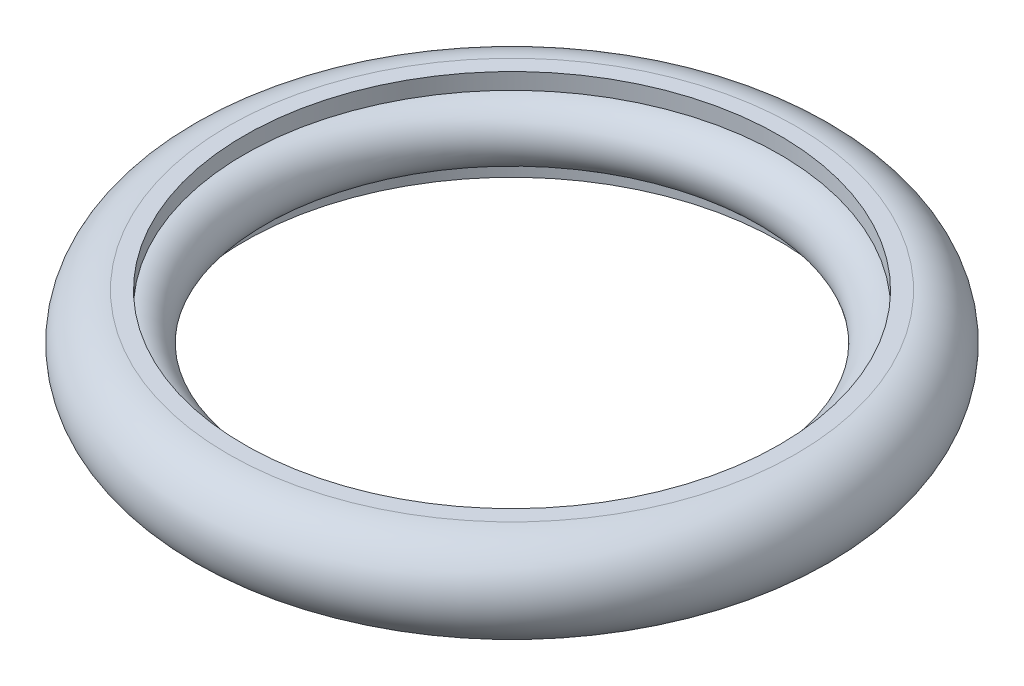
ISO-10303-21;
HEADER;
FILE_DESCRIPTION(('STEP AP214'),'2;1');
FILE_NAME('part.step','',(''),(''),'','','');
FILE_SCHEMA(('AUTOMOTIVE_DESIGN { 1 0 10303 214 1 1 1 1 }'));
ENDSEC;
DATA;
#1=APPLICATION_CONTEXT('core data for automotive mechanical design processes');
#2=APPLICATION_PROTOCOL_DEFINITION('international standard','automotive_design',2000,#1);
#3=PRODUCT_CONTEXT('',#1,'mechanical');
#4=PRODUCT('Part','Part','',(#3));
#5=PRODUCT_RELATED_PRODUCT_CATEGORY('part','',(#4));
#6=PRODUCT_DEFINITION_FORMATION('','',#4);
#7=PRODUCT_DEFINITION_CONTEXT('part definition',#1,'design');
#8=PRODUCT_DEFINITION('design','',#6,#7);
#9=PRODUCT_DEFINITION_SHAPE('','',#8);
#10=(LENGTH_UNIT() NAMED_UNIT(*) SI_UNIT(.MILLI.,.METRE.));
#11=(NAMED_UNIT(*) PLANE_ANGLE_UNIT() SI_UNIT($,.RADIAN.));
#12=(NAMED_UNIT(*) SI_UNIT($,.STERADIAN.) SOLID_ANGLE_UNIT());
#13=UNCERTAINTY_MEASURE_WITH_UNIT(LENGTH_MEASURE(1.E-05),#10,'distance_accuracy_value','');
#14=(GEOMETRIC_REPRESENTATION_CONTEXT(3) GLOBAL_UNCERTAINTY_ASSIGNED_CONTEXT((#13)) GLOBAL_UNIT_ASSIGNED_CONTEXT((#10,
#11,#12)) REPRESENTATION_CONTEXT('',''));
#15=CARTESIAN_POINT('',(0.,0.,0.));
#16=DIRECTION('',(0.,0.,1.));
#17=DIRECTION('',(1.,0.,0.));
#18=AXIS2_PLACEMENT_3D('',#15,#16,#17);
#19=CARTESIAN_POINT('',(0.,0.,0.));
#20=DIRECTION('',(0.,-1.,0.));
#21=DIRECTION('',(-1.,0.,0.));
#22=AXIS2_PLACEMENT_3D('',#19,#20,#21);
#23=TOROIDAL_SURFACE('',#22,11.785,1.3);
#24=CARTESIAN_POINT('',(0.,-1.3,0.));
#25=DIRECTION('',(0.,-1.,0.));
#26=DIRECTION('',(1.,0.,0.));
#27=AXIS2_PLACEMENT_3D('',#24,#25,#26);
#28=CIRCLE('',#27,11.785);
#29=CARTESIAN_POINT('',(11.785,-1.3,0.));
#30=VERTEX_POINT('',#29);
#31=EDGE_CURVE('E132',#30,#30,#28,.T.);
#32=ORIENTED_EDGE('',*,*,#31,.T.);
#33=EDGE_LOOP('',(#32));
#34=FACE_BOUND('',#33,.T.);
#35=CARTESIAN_POINT('',(0.,1.3,0.));
#36=DIRECTION('',(0.,-1.,0.));
#37=DIRECTION('',(1.,0.,0.));
#38=AXIS2_PLACEMENT_3D('',#35,#36,#37);
#39=CIRCLE('',#38,11.785);
#40=CARTESIAN_POINT('',(11.785,1.3,0.));
#41=VERTEX_POINT('',#40);
#42=EDGE_CURVE('E135',#41,#41,#39,.F.);
#43=ORIENTED_EDGE('',*,*,#42,.T.);
#44=EDGE_LOOP('',(#43));
#45=FACE_BOUND('',#44,.T.);
#46=ADVANCED_FACE('F16',(#34,#45),#23,.T.);
#47=CARTESIAN_POINT('',(0.,2.217875,0.));
#48=DIRECTION('',(0.,-1.,0.));
#49=DIRECTION('',(1.,0.,0.));
#50=AXIS2_PLACEMENT_3D('',#47,#48,#49);
#51=CYLINDRICAL_SURFACE('',#50,11.785);
#52=ORIENTED_EDGE('',*,*,#42,.F.);
#53=EDGE_LOOP('',(#52));
#54=FACE_BOUND('',#53,.T.);
#55=CARTESIAN_POINT('',(0.,2.01625,0.));
#56=DIRECTION('',(0.,-1.,0.));
#57=DIRECTION('',(1.,0.,0.));
#58=AXIS2_PLACEMENT_3D('',#55,#56,#57);
#59=CIRCLE('',#58,11.785);
#60=CARTESIAN_POINT('',(11.785,2.01625,0.));
#61=VERTEX_POINT('',#60);
#62=EDGE_CURVE('E57',#61,#61,#59,.F.);
#63=ORIENTED_EDGE('',*,*,#62,.T.);
#64=EDGE_LOOP('',(#63));
#65=FACE_BOUND('',#64,.T.);
#66=ADVANCED_FACE('F144',(#54,#65),#51,.F.);
#67=CARTESIAN_POINT('',(0.,2.217875,0.));
#68=DIRECTION('',(0.,-1.,0.));
#69=DIRECTION('',(1.,0.,0.));
#70=AXIS2_PLACEMENT_3D('',#67,#68,#69);
#71=CYLINDRICAL_SURFACE('',#70,11.785);
#72=CARTESIAN_POINT('',(0.,-2.01625,0.));
#73=DIRECTION('',(0.,-1.,0.));
#74=DIRECTION('',(1.,0.,0.));
#75=AXIS2_PLACEMENT_3D('',#72,#73,#74);
#76=CIRCLE('',#75,11.785);
#77=CARTESIAN_POINT('',(11.785,-2.01625,0.));
#78=VERTEX_POINT('',#77);
#79=EDGE_CURVE('E137',#78,#78,#76,.F.);
#80=ORIENTED_EDGE('',*,*,#79,.F.);
#81=EDGE_LOOP('',(#80));
#82=FACE_BOUND('',#81,.T.);
#83=ORIENTED_EDGE('',*,*,#31,.F.);
#84=EDGE_LOOP('',(#83));
#85=FACE_BOUND('',#84,.T.);
#86=ADVANCED_FACE('F112',(#82,#85),#71,.F.);
#87=CARTESIAN_POINT('',(0.,2.01625,0.));
#88=DIRECTION('',(0.,-1.,0.));
#89=DIRECTION('',(1.,0.,0.));
#90=AXIS2_PLACEMENT_3D('',#87,#88,#89);
#91=PLANE('',#90);
#92=ORIENTED_EDGE('',*,*,#62,.F.);
#93=EDGE_LOOP('',(#92));
#94=FACE_BOUND('',#93,.T.);
#95=CARTESIAN_POINT('',(0.,2.01625,0.));
#96=DIRECTION('',(0.,-1.,0.));
#97=DIRECTION('',(-1.,0.,0.));
#98=AXIS2_PLACEMENT_3D('',#95,#96,#97);
#99=CIRCLE('',#98,12.50125);
#100=CARTESIAN_POINT('',(-12.50125,2.01625,0.));
#101=VERTEX_POINT('',#100);
#102=CARTESIAN_POINT('',(12.50125,2.01625,0.));
#103=VERTEX_POINT('',#102);
#104=EDGE_CURVE('E47',#101,#103,#99,.T.);
#105=ORIENTED_EDGE('',*,*,#104,.F.);
#106=CARTESIAN_POINT('',(0.,2.01625,0.));
#107=DIRECTION('',(0.,-1.,0.));
#108=DIRECTION('',(1.,0.,0.));
#109=AXIS2_PLACEMENT_3D('',#106,#107,#108);
#110=CIRCLE('',#109,12.50125);
#111=EDGE_CURVE('E27',#103,#101,#110,.T.);
#112=ORIENTED_EDGE('',*,*,#111,.F.);
#113=EDGE_LOOP('',(#105,#112));
#114=FACE_BOUND('',#113,.T.);
#115=ADVANCED_FACE('F46',(#94,#114),#91,.F.);
#116=CARTESIAN_POINT('',(0.,-2.01625,0.));
#117=DIRECTION('',(0.,-1.,0.));
#118=DIRECTION('',(1.,0.,0.));
#119=AXIS2_PLACEMENT_3D('',#116,#117,#118);
#120=PLANE('',#119);
#121=ORIENTED_EDGE('',*,*,#79,.T.);
#122=EDGE_LOOP('',(#121));
#123=FACE_BOUND('',#122,.T.);
#124=CARTESIAN_POINT('',(0.,-2.01625,0.));
#125=DIRECTION('',(0.,1.,0.));
#126=DIRECTION('',(1.,0.,0.));
#127=AXIS2_PLACEMENT_3D('',#124,#125,#126);
#128=CIRCLE('',#127,12.50125);
#129=CARTESIAN_POINT('',(12.50125,-2.01625,0.));
#130=VERTEX_POINT('',#129);
#131=CARTESIAN_POINT('',(-12.50125,-2.01625,0.));
#132=VERTEX_POINT('',#131);
#133=EDGE_CURVE('E33',#130,#132,#128,.T.);
#134=ORIENTED_EDGE('',*,*,#133,.F.);
#135=CARTESIAN_POINT('',(0.,-2.01625,0.));
#136=DIRECTION('',(0.,1.,0.));
#137=DIRECTION('',(-1.,0.,0.));
#138=AXIS2_PLACEMENT_3D('',#135,#136,#137);
#139=CIRCLE('',#138,12.50125);
#140=EDGE_CURVE('E10',#132,#130,#139,.T.);
#141=ORIENTED_EDGE('',*,*,#140,.F.);
#142=EDGE_LOOP('',(#134,#141));
#143=FACE_BOUND('',#142,.T.);
#144=ADVANCED_FACE('F70',(#123,#143),#120,.T.);
#145=CARTESIAN_POINT('',(0.,0.,0.));
#146=DIRECTION('',(0.,-1.,0.));
#147=DIRECTION('',(-1.,0.,0.));
#148=AXIS2_PLACEMENT_3D('',#145,#146,#147);
#149=TOROIDAL_SURFACE('',#148,12.50125,2.01625);
#150=ORIENTED_EDGE('',*,*,#133,.T.);
#151=ORIENTED_EDGE('',*,*,#140,.T.);
#152=EDGE_LOOP('',(#150,#151));
#153=FACE_BOUND('',#152,.T.);
#154=ORIENTED_EDGE('',*,*,#111,.T.);
#155=ORIENTED_EDGE('',*,*,#104,.T.);
#156=EDGE_LOOP('',(#154,#155));
#157=FACE_BOUND('',#156,.T.);
#158=ADVANCED_FACE('F54',(#153,#157),#149,.T.);
#159=CLOSED_SHELL('',(#46,#66,#86,#115,#144,#158));
#160=MANIFOLD_SOLID_BREP('B1',#159);
#161=ADVANCED_BREP_SHAPE_REPRESENTATION('',(#18,#160),#14);
#162=SHAPE_DEFINITION_REPRESENTATION(#9,#161);
ENDSEC;
END-ISO-10303-21;
